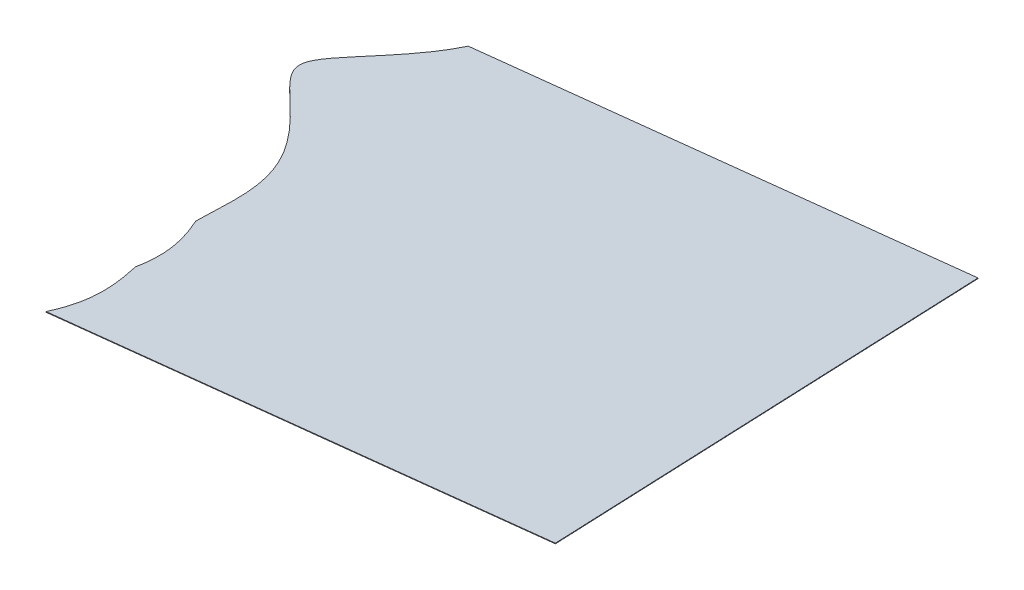
ISO-10303-21;
HEADER;
FILE_DESCRIPTION(('STEP AP214'),'2;1');
FILE_NAME('part.step','',(''),(''),'','','');
FILE_SCHEMA(('AUTOMOTIVE_DESIGN { 1 0 10303 214 1 1 1 1 }'));
ENDSEC;
DATA;
#1=APPLICATION_CONTEXT('core data for automotive mechanical design processes');
#2=APPLICATION_PROTOCOL_DEFINITION('international standard','automotive_design',2000,#1);
#3=PRODUCT_CONTEXT('',#1,'mechanical');
#4=PRODUCT('Part','Part','',(#3));
#5=PRODUCT_RELATED_PRODUCT_CATEGORY('part','',(#4));
#6=PRODUCT_DEFINITION_FORMATION('','',#4);
#7=PRODUCT_DEFINITION_CONTEXT('part definition',#1,'design');
#8=PRODUCT_DEFINITION('design','',#6,#7);
#9=PRODUCT_DEFINITION_SHAPE('','',#8);
#10=(LENGTH_UNIT() NAMED_UNIT(*) SI_UNIT(.MILLI.,.METRE.));
#11=(NAMED_UNIT(*) PLANE_ANGLE_UNIT() SI_UNIT($,.RADIAN.));
#12=(NAMED_UNIT(*) SI_UNIT($,.STERADIAN.) SOLID_ANGLE_UNIT());
#13=UNCERTAINTY_MEASURE_WITH_UNIT(LENGTH_MEASURE(1.E-05),#10,'distance_accuracy_value','');
#14=(GEOMETRIC_REPRESENTATION_CONTEXT(3) GLOBAL_UNCERTAINTY_ASSIGNED_CONTEXT((#13)) GLOBAL_UNIT_ASSIGNED_CONTEXT((#10,
#11,#12)) REPRESENTATION_CONTEXT('',''));
#15=CARTESIAN_POINT('',(0.,0.,0.));
#16=DIRECTION('',(0.,0.,1.));
#17=DIRECTION('',(1.,0.,0.));
#18=AXIS2_PLACEMENT_3D('',#15,#16,#17);
#19=CARTESIAN_POINT('',(1655.15665401852,617.20645742832,330.964538238841));
#20=DIRECTION('',(-0.996335475185747,-0.036820136022395,0.0772003786887326));
#21=DIRECTION('',(0.0772527631007789,0.,0.997011539849612));
#22=AXIS2_PLACEMENT_3D('',#19,#20,#21);
#23=PLANE('',#22);
#24=DIRECTION('',(-0.0758883967493987,-0.0357915138957146,-0.996473742138677));
#25=VECTOR('',#24,1.);
#26=CARTESIAN_POINT('',(1655.16059936024,617.106589353085,330.967824852232));
#27=LINE('',#26,#25);
#28=CARTESIAN_POINT('',(1655.16059936024,617.106589353085,330.967824852232));
#29=VERTEX_POINT('',#28);
#30=CARTESIAN_POINT('',(1649.13643446242,614.265391081862,251.86584884381));
#31=VERTEX_POINT('',#30);
#32=EDGE_CURVE('E176',#29,#31,#27,.T.);
#33=ORIENTED_EDGE('',*,*,#32,.T.);
#34=DIRECTION('',(0.0394534171548831,-0.998680752350993,0.0328661339140675));
#35=VECTOR('',#34,1.);
#36=CARTESIAN_POINT('',(1649.13248912071,614.365259157097,251.862562230418));
#37=LINE('',#36,#35);
#38=CARTESIAN_POINT('',(1649.13248912071,614.365259157097,251.862562230418));
#39=VERTEX_POINT('',#38);
#40=EDGE_CURVE('E13',#39,#31,#37,.T.);
#41=ORIENTED_EDGE('',*,*,#40,.F.);
#42=DIRECTION('',(-0.0758883967493987,-0.0357915138957146,-0.996473742138677));
#43=VECTOR('',#42,1.);
#44=CARTESIAN_POINT('',(1655.15665401852,617.20645742832,330.964538238841));
#45=LINE('',#44,#43);
#46=CARTESIAN_POINT('',(1655.15665401852,617.20645742832,330.964538238841));
#47=VERTEX_POINT('',#46);
#48=EDGE_CURVE('E156',#47,#39,#45,.T.);
#49=ORIENTED_EDGE('',*,*,#48,.F.);
#50=DIRECTION('',(0.0394534171548831,-0.998680752350993,0.0328661339140675));
#51=VECTOR('',#50,1.);
#52=CARTESIAN_POINT('',(1655.15665401852,617.20645742832,330.964538238841));
#53=LINE('',#52,#51);
#54=EDGE_CURVE('E58',#47,#29,#53,.T.);
#55=ORIENTED_EDGE('',*,*,#54,.T.);
#56=EDGE_LOOP('',(#33,#41,#49,#55));
#57=FACE_BOUND('',#56,.T.);
#58=ADVANCED_FACE('F42',(#57),#23,.F.);
#59=CARTESIAN_POINT('',(1649.13248912071,614.365259157097,251.862562230418));
#60=DIRECTION('',(0.0758883967493995,0.0357915138957124,0.996473742138677));
#61=DIRECTION('',(0.997112613623651,0.,-0.0759370512504398));
#62=AXIS2_PLACEMENT_3D('',#59,#60,#61);
#63=PLANE('',#62);
#64=DIRECTION('',(-0.996335475185747,-0.0368201360223934,0.0772003786887332));
#65=VECTOR('',#64,1.);
#66=CARTESIAN_POINT('',(1649.13643446242,614.265391081862,251.86584884381));
#67=LINE('',#66,#65);
#68=CARTESIAN_POINT('',(1567.32972220353,611.242178170211,258.204586470802));
#69=VERTEX_POINT('',#68);
#70=EDGE_CURVE('E174',#31,#69,#67,.T.);
#71=ORIENTED_EDGE('',*,*,#70,.T.);
#72=DIRECTION('',(0.0394534171548831,-0.998680752350993,0.0328661339140675));
#73=VECTOR('',#72,1.);
#74=CARTESIAN_POINT('',(1567.32577686181,611.342046245446,258.20129985741));
#75=LINE('',#74,#73);
#76=CARTESIAN_POINT('',(1567.32577686181,611.342046245446,258.20129985741));
#77=VERTEX_POINT('',#76);
#78=EDGE_CURVE('E50',#77,#69,#75,.T.);
#79=ORIENTED_EDGE('',*,*,#78,.F.);
#80=DIRECTION('',(-0.996335475185747,-0.0368201360223934,0.0772003786887332));
#81=VECTOR('',#80,1.);
#82=CARTESIAN_POINT('',(1649.13248912071,614.365259157097,251.862562230418));
#83=LINE('',#82,#81);
#84=EDGE_CURVE('E91',#39,#77,#83,.T.);
#85=ORIENTED_EDGE('',*,*,#84,.F.);
#86=ORIENTED_EDGE('',*,*,#40,.T.);
#87=EDGE_LOOP('',(#71,#79,#85,#86));
#88=FACE_BOUND('',#87,.T.);
#89=ADVANCED_FACE('F146',(#88),#63,.F.);
#90=CARTESIAN_POINT('',(1567.32577686181,611.342046245446,258.20129985741));
#91=CARTESIAN_POINT('',(1566.94331983609,611.354556161505,259.040542131338));
#92=CARTESIAN_POINT('',(1566.03141489354,611.372960620507,260.694461792502));
#93=CARTESIAN_POINT('',(1565.02286523363,611.385362528978,262.28200104713));
#94=CARTESIAN_POINT('',(1563.93144320108,611.392994379776,263.824078109537));
#95=CARTESIAN_POINT('',(1563.32401569155,611.395028193321,264.615051012943));
#96=CARTESIAN_POINT('',(1562.78444921036,611.396834791805,265.317657430197));
#97=CARTESIAN_POINT('',(1562.15063215641,611.397436627132,266.096796529823));
#98=CARTESIAN_POINT('',(1561.62229934543,611.397938300837,266.746265880772));
#99=CARTESIAN_POINT('',(1560.63575322169,611.397510805001,267.917553139581));
#100=CARTESIAN_POINT('',(1560.03088220946,611.397027708985,268.628977541936));
#101=CARTESIAN_POINT('',(1559.35566634643,611.396513177688,269.423890648507));
#102=CARTESIAN_POINT('',(1559.11000034176,611.396412380457,269.715732066001));
#103=CARTESIAN_POINT('',(1558.76858287483,611.396272296219,270.121322402527));
#104=CARTESIAN_POINT('',(1558.16996258497,611.396539578508,270.84804449746));
#105=CARTESIAN_POINT('',(1557.58050451633,611.397755502209,271.592593726706));
#106=CARTESIAN_POINT('',(1557.01401556851,611.400570438868,272.358158301418));
#107=CARTESIAN_POINT('',(1556.49035944773,611.406003522136,273.151860996516));
#108=CARTESIAN_POINT('',(1556.03924805121,611.415798030268,273.991006632937));
#109=CARTESIAN_POINT('',(1555.72397151437,611.432801624579,274.886149918208));
#110=CARTESIAN_POINT('',(1555.64058387472,611.46008806386,275.815385134095));
#111=CARTESIAN_POINT('',(1555.83927690404,611.497984836317,276.728411848338));
#112=CARTESIAN_POINT('',(1556.25222787751,611.541914529331,277.567555628406));
#113=CARTESIAN_POINT('',(1556.67321592297,611.578705009471,278.180117101658));
#114=CARTESIAN_POINT('',(1556.96216625129,611.602505309528,278.556456581076));
#115=CARTESIAN_POINT('',(1557.34335179667,611.632747156863,279.0178092474));
#116=CARTESIAN_POINT('',(1557.62099248472,611.653820038655,279.324848937074));
#117=CARTESIAN_POINT('',(1557.96857024268,611.680201132358,279.709231239594));
#118=CARTESIAN_POINT('',(1558.41559987236,611.712885110376,280.165750200271));
#119=CARTESIAN_POINT('',(1558.71502610774,611.734777262137,280.471532512445));
#120=CARTESIAN_POINT('',(1559.08439568089,611.761349276841,280.835556702625));
#121=CARTESIAN_POINT('',(1559.37899413108,611.782542344488,281.125891830509));
#122=CARTESIAN_POINT('',(1559.76387331886,611.81000082987,281.49823442858));
#123=CARTESIAN_POINT('',(1560.00843985478,611.827448971688,281.734834749604));
#124=CARTESIAN_POINT('',(1560.93925269822,611.893671868826,282.62973116206));
#125=CARTESIAN_POINT('',(1561.13166982364,611.907380894571,282.815315114329));
#126=CARTESIAN_POINT('',(1561.91448931075,611.963153957798,283.570334887201));
#127=CARTESIAN_POINT('',(1562.47971780974,612.003932859384,284.130939563295));
#128=CARTESIAN_POINT('',(1563.19480351086,612.055523339134,284.840175542317));
#129=CARTESIAN_POINT('',(1563.79918779346,612.10017029205,285.471312364162));
#130=CARTESIAN_POINT('',(1564.48611114247,612.150914554108,286.188641771663));
#131=CARTESIAN_POINT('',(1565.74173006511,612.246970955206,287.600162271624));
#132=CARTESIAN_POINT('',(1566.92963191905,612.342316366183,289.071367844864));
#133=CARTESIAN_POINT('',(1568.03146412699,612.43657425824,290.612848110021));
#134=CARTESIAN_POINT('',(1569.02264299598,612.528935564279,292.2295294437));
#135=CARTESIAN_POINT('',(1569.87906273731,612.618380886209,293.919373348993));
#136=CARTESIAN_POINT('',(1570.58059279982,612.703958681082,295.67763121152));
#137=CARTESIAN_POINT('',(1571.1149653973,612.78463839991,297.487715033681));
#138=CARTESIAN_POINT('',(1571.48609497536,612.860254685335,299.339901205485));
#139=CARTESIAN_POINT('',(1571.7089779204,612.930719624378,301.213516297881));
#140=CARTESIAN_POINT('',(1571.76477674799,612.965791353485,302.212234506579));
#141=CARTESIAN_POINT('',(1571.81337964781,612.996340162661,303.08215602896));
#142=CARTESIAN_POINT('',(1571.82763443207,613.031072820168,304.120441720547));
#143=CARTESIAN_POINT('',(1571.83365899922,613.045752048136,304.559257332606));
#144=CARTESIAN_POINT('',(1571.83427646277,613.062602041831,305.070525356343));
#145=CARTESIAN_POINT('',(1571.83477079783,613.07609197621,305.47984136055));
#146=CARTESIAN_POINT('',(1571.83172339451,613.093906086167,306.024804733953));
#147=CARTESIAN_POINT('',(1571.83153937009,613.094981831941,306.057713593695));
#148=CARTESIAN_POINT('',(1571.82541435353,613.1251773739,306.982597532721));
#149=CARTESIAN_POINT('',(1571.82163957423,613.143786549138,307.552593173767));
#150=CARTESIAN_POINT('',(1571.82086150963,613.156284034321,307.93327972622));
#151=CARTESIAN_POINT('',(1571.81866441963,613.191574291048,309.008258089649));
#152=CARTESIAN_POINT('',(1571.83728629953,613.219423837033,309.83214899241));
#153=B_SPLINE_CURVE_WITH_KNOTS('',2,(#90,#91,#92,#93,#94,#95,#96,#97,#98,#99,#100,#101,#102,
#103,#104,#105,#106,#107,#108,#109,#110,#111,#112,#113,#114,#115,#116,#117,#118,#119,#120,#121,
#122,#123,#124,#125,#126,#127,#128,#129,#130,#131,#132,#133,#134,#135,#136,#137,#138,#139,#140,
#141,#142,#143,#144,#145,#146,#147,#148,#149,#150,#151,#152),.UNSPECIFIED.,.F.,.F.,(3,1,1,1,2,2,
1,1,1,2,1,1,1,1,1,1,1,1,1,1,1,1,2,2,2,2,1,2,2,2,1,1,1,1,1,1,1,1,1,2,2,2,2,2,2,3),(0.,0.03125,
0.0625,0.09375,0.125,0.15625,0.1875,0.203125,0.21875,0.234375,0.25,0.265625,0.28125,0.296875,
0.3125,0.328125,0.34375,0.359375,0.375,0.390625,0.3984375,0.40625,0.418389320373535,0.4375,
0.453125,0.46875,0.484375,0.5,0.53125,0.5625,0.59375,0.625,0.65625,0.6875,0.71875,0.75,0.78125,
0.8125,0.84375,0.875,0.90625,0.921875,0.9375,0.953125,0.96875,1.),.UNSPECIFIED.);
#154=DIRECTION('',(0.0394534171548831,-0.998680752350993,0.0328661339140675));
#155=VECTOR('',#154,1.);
#156=SURFACE_OF_LINEAR_EXTRUSION('',#153,#155);
#157=CARTESIAN_POINT('',(1567.32972220353,611.242178170211,258.204586470802));
#158=CARTESIAN_POINT('',(1566.94726517781,611.25468808627,259.043828744729));
#159=CARTESIAN_POINT('',(1566.03536023526,611.273092545272,260.697748405893));
#160=CARTESIAN_POINT('',(1565.02681057534,611.285494453743,262.285287660521));
#161=CARTESIAN_POINT('',(1563.93538854279,611.293126304541,263.827364722928));
#162=CARTESIAN_POINT('',(1563.32796103327,611.295160118086,264.618337626334));
#163=CARTESIAN_POINT('',(1562.78839455208,611.29696671657,265.320944043589));
#164=CARTESIAN_POINT('',(1562.15457749813,611.297568551896,266.100083143214));
#165=CARTESIAN_POINT('',(1561.62624468715,611.298070225601,266.749552494163));
#166=CARTESIAN_POINT('',(1560.6396985634,611.297642729766,267.920839752972));
#167=CARTESIAN_POINT('',(1560.03482755118,611.29715963375,268.632264155328));
#168=CARTESIAN_POINT('',(1559.35961168814,611.296645102452,269.427177261899));
#169=CARTESIAN_POINT('',(1559.11394568347,611.296544305222,269.719018679393));
#170=CARTESIAN_POINT('',(1558.77252821654,611.296404220984,270.124609015918));
#171=CARTESIAN_POINT('',(1558.17390792668,611.296671503272,270.851331110852));
#172=CARTESIAN_POINT('',(1557.58444985805,611.297887426974,271.595880340098));
#173=CARTESIAN_POINT('',(1557.01796091023,611.300702363633,272.361444914809));
#174=CARTESIAN_POINT('',(1556.49430478944,611.306135446901,273.155147609907));
#175=CARTESIAN_POINT('',(1556.04319339292,611.315929955033,273.994293246328));
#176=CARTESIAN_POINT('',(1555.72791685609,611.332933549343,274.889436531599));
#177=CARTESIAN_POINT('',(1555.64452921643,611.360219988625,275.818671747486));
#178=CARTESIAN_POINT('',(1555.84322224576,611.398116761082,276.73169846173));
#179=CARTESIAN_POINT('',(1556.25617321923,611.442046454096,277.570842241797));
#180=CARTESIAN_POINT('',(1556.67716126469,611.478836934235,278.183403715049));
#181=CARTESIAN_POINT('',(1556.96611159301,611.502637234293,278.559743194468));
#182=CARTESIAN_POINT('',(1557.34729713839,611.532879081628,279.021095860791));
#183=CARTESIAN_POINT('',(1557.62493782643,611.55395196342,279.328135550466));
#184=CARTESIAN_POINT('',(1557.9725155844,611.580333057123,279.712517852986));
#185=CARTESIAN_POINT('',(1558.41954521407,611.61301703514,280.169036813662));
#186=CARTESIAN_POINT('',(1558.71897144945,611.634909186902,280.474819125837));
#187=CARTESIAN_POINT('',(1559.08834102261,611.661481201606,280.838843316016));
#188=CARTESIAN_POINT('',(1559.38293947279,611.682674269253,281.1291784439));
#189=CARTESIAN_POINT('',(1559.76781866058,611.710132754635,281.501521041972));
#190=CARTESIAN_POINT('',(1560.0123851965,611.727580896453,281.738121362995));
#191=CARTESIAN_POINT('',(1560.94319803994,611.793803793591,282.633017775451));
#192=CARTESIAN_POINT('',(1561.13561516536,611.807512819336,282.818601727721));
#193=CARTESIAN_POINT('',(1561.91843465246,611.863285882563,283.573621500592));
#194=CARTESIAN_POINT('',(1562.48366315146,611.904064784149,284.134226176686));
#195=CARTESIAN_POINT('',(1563.19874885257,611.955655263899,284.843462155708));
#196=CARTESIAN_POINT('',(1563.80313313518,612.000302216815,285.474598977553));
#197=CARTESIAN_POINT('',(1564.49005648418,612.051046478873,286.191928385054));
#198=CARTESIAN_POINT('',(1565.74567540683,612.147102879971,287.603448885015));
#199=CARTESIAN_POINT('',(1566.93357726077,612.242448290948,289.074654458256));
#200=CARTESIAN_POINT('',(1568.0354094687,612.336706183005,290.616134723412));
#201=CARTESIAN_POINT('',(1569.0265883377,612.429067489044,292.232816057092));
#202=CARTESIAN_POINT('',(1569.88300807903,612.518512810974,293.922659962384));
#203=CARTESIAN_POINT('',(1570.58453814154,612.604090605847,295.680917824912));
#204=CARTESIAN_POINT('',(1571.11891073902,612.684770324675,297.491001647072));
#205=CARTESIAN_POINT('',(1571.49004031708,612.7603866101,299.343187818877));
#206=CARTESIAN_POINT('',(1571.71292326212,612.830851549143,301.216802911273));
#207=CARTESIAN_POINT('',(1571.76872208971,612.86592327825,302.21552111997));
#208=CARTESIAN_POINT('',(1571.81732498952,612.896472087426,303.085442642352));
#209=CARTESIAN_POINT('',(1571.83157977378,612.931204744933,304.123728333938));
#210=CARTESIAN_POINT('',(1571.83760434094,612.945883972901,304.562543945997));
#211=CARTESIAN_POINT('',(1571.83822180448,612.962733966596,305.073811969735));
#212=CARTESIAN_POINT('',(1571.83871613954,612.976223900975,305.483127973942));
#213=CARTESIAN_POINT('',(1571.83566873622,612.994038010932,306.028091347345));
#214=CARTESIAN_POINT('',(1571.8354847118,612.995113756706,306.061000207086));
#215=CARTESIAN_POINT('',(1571.82935969524,613.025309298665,306.985884146112));
#216=CARTESIAN_POINT('',(1571.82558491595,613.043918473903,307.555879787158));
#217=CARTESIAN_POINT('',(1571.82480685134,613.056415959086,307.936566339611));
#218=CARTESIAN_POINT('',(1571.82260976135,613.091706215813,309.011544703041));
#219=CARTESIAN_POINT('',(1571.84123164125,613.119555761798,309.835435605801));
#220=B_SPLINE_CURVE_WITH_KNOTS('',2,(#157,#158,#159,#160,#161,#162,#163,#164,#165,#166,#167,
#168,#169,#170,#171,#172,#173,#174,#175,#176,#177,#178,#179,#180,#181,#182,#183,#184,#185,#186,
#187,#188,#189,#190,#191,#192,#193,#194,#195,#196,#197,#198,#199,#200,#201,#202,#203,#204,#205,
#206,#207,#208,#209,#210,#211,#212,#213,#214,#215,#216,#217,#218,#219),.UNSPECIFIED.,.F.,.F.,(3,
1,1,1,2,2,1,1,1,2,1,1,1,1,1,1,1,1,1,1,1,1,2,2,2,2,1,2,2,2,1,1,1,1,1,1,1,1,1,2,2,2,2,2,2,3),(0.,
0.03125,0.0625,0.09375,0.125,0.15625,0.1875,0.203125,0.21875,0.234375,0.25,0.265625,0.28125,
0.296875,0.3125,0.328125,0.34375,0.359375,0.375,0.390625,0.3984375,0.40625,0.418389320373535,
0.4375,0.453125,0.46875,0.484375,0.5,0.53125,0.5625,0.59375,0.625,0.65625,0.6875,0.71875,0.75,
0.78125,0.8125,0.84375,0.875,0.90625,0.921875,0.9375,0.953125,0.96875,1.),.UNSPECIFIED.);
#221=CARTESIAN_POINT('',(1571.84123161385,613.119555720822,309.835434393596));
#222=VERTEX_POINT('',#221);
#223=EDGE_CURVE('E172',#69,#222,#220,.T.);
#224=ORIENTED_EDGE('',*,*,#223,.T.);
#225=DIRECTION('',(0.0394534171548831,-0.998680752350993,0.0328661339140675));
#226=VECTOR('',#225,1.);
#227=CARTESIAN_POINT('',(1571.83728627213,613.219423796057,309.832147780204));
#228=LINE('',#227,#226);
#229=CARTESIAN_POINT('',(1571.83728627213,613.219423796057,309.832147780204));
#230=VERTEX_POINT('',#229);
#231=EDGE_CURVE('E119',#230,#222,#228,.T.);
#232=ORIENTED_EDGE('',*,*,#231,.F.);
#233=EDGE_CURVE('E107',#77,#230,#153,.T.);
#234=ORIENTED_EDGE('',*,*,#233,.F.);
#235=ORIENTED_EDGE('',*,*,#78,.T.);
#236=EDGE_LOOP('',(#224,#232,#234,#235));
#237=FACE_BOUND('',#236,.T.);
#238=ADVANCED_FACE('F144',(#237),#156,.F.);
#239=CARTESIAN_POINT('',(1571.83728629953,613.219423837033,309.83214899241));
#240=CARTESIAN_POINT('',(1572.20716136136,613.259393529501,310.602672458978));
#241=CARTESIAN_POINT('',(1572.8383015818,613.332887036993,312.078231253993));
#242=CARTESIAN_POINT('',(1573.38363969341,613.404438307202,313.597771839047));
#243=CARTESIAN_POINT('',(1573.81586568981,613.472738412779,315.154304421068));
#244=CARTESIAN_POINT('',(1574.11401893622,613.536841332657,316.74424463069));
#245=CARTESIAN_POINT('',(1574.26371068422,613.595650878482,318.351555993486));
#246=CARTESIAN_POINT('',(1574.26309847111,613.648860807408,319.969144660604));
#247=CARTESIAN_POINT('',(1574.11867474654,613.696247121456,321.582410442197));
#248=CARTESIAN_POINT('',(1573.97982609803,613.717787988366,322.403635807308));
#249=B_SPLINE_CURVE_WITH_KNOTS('',2,(#239,#240,#241,#242,#243,#244,#245,#246,#247,#248),
.UNSPECIFIED.,.F.,.F.,(3,1,1,1,1,1,1,1,3),(0.,0.125,0.25,0.375,0.5,0.625,0.75,0.875,1.),.UNSPECIFIED.);
#250=DIRECTION('',(0.0394534171548831,-0.998680752350993,0.0328661339140675));
#251=VECTOR('',#250,1.);
#252=SURFACE_OF_LINEAR_EXTRUSION('',#249,#251);
#253=CARTESIAN_POINT('',(1571.84123164125,613.119555761798,309.835435605801));
#254=CARTESIAN_POINT('',(1572.21110670307,613.159525454266,310.605959072369));
#255=CARTESIAN_POINT('',(1572.84224692352,613.233018961758,312.081517867385));
#256=CARTESIAN_POINT('',(1573.38758503512,613.304570231967,313.601058452438));
#257=CARTESIAN_POINT('',(1573.81981103152,613.372870337544,315.157591034459));
#258=CARTESIAN_POINT('',(1574.11796427793,613.436973257422,316.747531244081));
#259=CARTESIAN_POINT('',(1574.26765602594,613.495782803247,318.354842606877));
#260=CARTESIAN_POINT('',(1574.26704381282,613.548992732173,319.972431273996));
#261=CARTESIAN_POINT('',(1574.12262008826,613.596379046221,321.585697055588));
#262=CARTESIAN_POINT('',(1573.98377143975,613.617919913131,322.406922420699));
#263=B_SPLINE_CURVE_WITH_KNOTS('',2,(#253,#254,#255,#256,#257,#258,#259,#260,#261,#262),
.UNSPECIFIED.,.F.,.F.,(3,1,1,1,1,1,1,1,3),(0.,0.125,0.25,0.375,0.5,0.625,0.75,0.875,1.),.UNSPECIFIED.);
#264=CARTESIAN_POINT('',(1573.98377164829,613.617919880779,322.406921187294));
#265=VERTEX_POINT('',#264);
#266=EDGE_CURVE('E116',#222,#265,#263,.T.);
#267=ORIENTED_EDGE('',*,*,#266,.T.);
#268=DIRECTION('',(0.0394534171548831,-0.998680752350993,0.0328661339140675));
#269=VECTOR('',#268,1.);
#270=CARTESIAN_POINT('',(1573.97982630657,613.717787956014,322.403634573903));
#271=LINE('',#270,#269);
#272=CARTESIAN_POINT('',(1573.97982630657,613.717787956014,322.403634573903));
#273=VERTEX_POINT('',#272);
#274=EDGE_CURVE('E113',#273,#265,#271,.T.);
#275=ORIENTED_EDGE('',*,*,#274,.F.);
#276=EDGE_CURVE('E100',#230,#273,#249,.T.);
#277=ORIENTED_EDGE('',*,*,#276,.F.);
#278=ORIENTED_EDGE('',*,*,#231,.T.);
#279=EDGE_LOOP('',(#267,#275,#277,#278));
#280=FACE_BOUND('',#279,.T.);
#281=ADVANCED_FACE('F114',(#280),#252,.F.);
#282=CARTESIAN_POINT('',(1573.97982609803,613.717787988366,322.403635807308));
#283=CARTESIAN_POINT('',(1574.23105762763,613.760428673285,323.397743877362));
#284=CARTESIAN_POINT('',(1574.41327668485,613.794610902143,324.217675105837));
#285=CARTESIAN_POINT('',(1574.43308427239,613.798354263453,324.30764449144));
#286=CARTESIAN_POINT('',(1574.63733540209,613.837305059404,325.246026999736));
#287=CARTESIAN_POINT('',(1574.77547874918,613.870065001395,326.075649871899));
#288=CARTESIAN_POINT('',(1574.79027477202,613.873628499426,326.166169895978));
#289=CARTESIAN_POINT('',(1574.94739928878,613.912218656568,327.150166010266));
#290=CARTESIAN_POINT('',(1575.10174873528,613.978565784318,328.980925494001));
#291=CARTESIAN_POINT('',(1575.08036423627,614.039872827301,330.869491260006));
#292=CARTESIAN_POINT('',(1574.85574406836,614.092910414965,332.7507484623));
#293=CARTESIAN_POINT('',(1574.42711520302,614.136844631374,334.600285432015));
#294=CARTESIAN_POINT('',(1573.80704770332,614.171719984621,336.404365154441));
#295=CARTESIAN_POINT('',(1573.40477121572,614.185270769956,337.299027442607));
#296=B_SPLINE_CURVE_WITH_KNOTS('',2,(#282,#283,#284,#285,#286,#287,#288,#289,#290,#291,#292,
#293,#294,#295),.UNSPECIFIED.,.F.,.F.,(3,1,1,1,1,1,1,1,1,1,1,1,3),(0.,0.11875,0.125,0.13125,
0.2440625,0.25,0.25625,0.375,0.5,0.625,0.75,0.875,1.),.UNSPECIFIED.);
#297=DIRECTION('',(0.0394534171548831,-0.998680752350993,0.0328661339140675));
#298=VECTOR('',#297,1.);
#299=SURFACE_OF_LINEAR_EXTRUSION('',#296,#298);
#300=CARTESIAN_POINT('',(1573.98377143975,613.617919913131,322.406922420699));
#301=CARTESIAN_POINT('',(1574.23500296934,613.66056059805,323.401030490753));
#302=CARTESIAN_POINT('',(1574.41722202657,613.694742826908,324.220961719228));
#303=CARTESIAN_POINT('',(1574.43702961411,613.698486188218,324.310931104832));
#304=CARTESIAN_POINT('',(1574.6412807438,613.737436984169,325.249313613127));
#305=CARTESIAN_POINT('',(1574.7794240909,613.77019692616,326.078936485291));
#306=CARTESIAN_POINT('',(1574.79422011374,613.773760424191,326.169456509369));
#307=CARTESIAN_POINT('',(1574.9513446305,613.812350581333,327.153452623657));
#308=CARTESIAN_POINT('',(1575.105694077,613.878697709083,328.984212107392));
#309=CARTESIAN_POINT('',(1575.08430957799,613.940004752066,330.872777873397));
#310=CARTESIAN_POINT('',(1574.85968941007,613.99304233973,332.754035075692));
#311=CARTESIAN_POINT('',(1574.43106054474,614.036976556139,334.603572045406));
#312=CARTESIAN_POINT('',(1573.81099304504,614.071851909386,336.407651767832));
#313=CARTESIAN_POINT('',(1573.40871655744,614.085402694721,337.302314055999));
#314=B_SPLINE_CURVE_WITH_KNOTS('',2,(#300,#301,#302,#303,#304,#305,#306,#307,#308,#309,#310,
#311,#312,#313),.UNSPECIFIED.,.F.,.F.,(3,1,1,1,1,1,1,1,1,1,1,1,3),(0.,0.11875,0.125,0.13125,
0.2440625,0.25,0.25625,0.375,0.5,0.625,0.75,0.875,1.),.UNSPECIFIED.);
#315=CARTESIAN_POINT('',(1573.40871655744,614.085402694721,337.302314055999));
#316=VERTEX_POINT('',#315);
#317=EDGE_CURVE('E160',#265,#316,#314,.T.);
#318=ORIENTED_EDGE('',*,*,#317,.T.);
#319=DIRECTION('',(0.0394534171548831,-0.998680752350993,0.0328661339140675));
#320=VECTOR('',#319,1.);
#321=CARTESIAN_POINT('',(1573.40477121572,614.185270769956,337.299027442607));
#322=LINE('',#321,#320);
#323=CARTESIAN_POINT('',(1573.40477121572,614.185270769956,337.299027442607));
#324=VERTEX_POINT('',#323);
#325=EDGE_CURVE('E79',#324,#316,#322,.T.);
#326=ORIENTED_EDGE('',*,*,#325,.F.);
#327=EDGE_CURVE('E105',#273,#324,#296,.T.);
#328=ORIENTED_EDGE('',*,*,#327,.F.);
#329=ORIENTED_EDGE('',*,*,#274,.T.);
#330=EDGE_LOOP('',(#318,#326,#328,#329));
#331=FACE_BOUND('',#330,.T.);
#332=ADVANCED_FACE('F121',(#331),#299,.F.);
#333=CARTESIAN_POINT('',(1655.15665401852,617.20645742832,330.964538238841));
#334=DIRECTION('',(0.0758883967493986,0.0357915138957124,0.996473742138677));
#335=DIRECTION('',(0.997112613623651,0.,-0.0759370512504389));
#336=AXIS2_PLACEMENT_3D('',#333,#334,#335);
#337=PLANE('',#336);
#338=DIRECTION('',(-0.996335475185747,-0.0368201360223939,0.0772003786887323));
#339=VECTOR('',#338,1.);
#340=CARTESIAN_POINT('',(1655.16059936024,617.106589353085,330.967824852232));
#341=LINE('',#340,#339);
#342=EDGE_CURVE('E157',#29,#316,#341,.T.);
#343=ORIENTED_EDGE('',*,*,#342,.F.);
#344=ORIENTED_EDGE('',*,*,#54,.F.);
#345=DIRECTION('',(-0.996335475185747,-0.0368201360223939,0.0772003786887323));
#346=VECTOR('',#345,1.);
#347=CARTESIAN_POINT('',(1655.15665401852,617.20645742832,330.964538238841));
#348=LINE('',#347,#346);
#349=EDGE_CURVE('E122',#47,#324,#348,.T.);
#350=ORIENTED_EDGE('',*,*,#349,.T.);
#351=ORIENTED_EDGE('',*,*,#325,.T.);
#352=EDGE_LOOP('',(#343,#344,#350,#351));
#353=FACE_BOUND('',#352,.T.);
#354=ADVANCED_FACE('F140',(#353),#337,.T.);
#355=CARTESIAN_POINT('',(2529.66623413217,615.349277157291,-775.253843136527));
#356=DIRECTION('',(-0.0394534171548821,0.998680752350993,-0.0328661339140692));
#357=DIRECTION('',(-0.999220568580464,-0.039474742883688,0.));
#358=AXIS2_PLACEMENT_3D('',#355,#356,#357);
#359=PLANE('',#358);
#360=ORIENTED_EDGE('',*,*,#48,.T.);
#361=ORIENTED_EDGE('',*,*,#84,.T.);
#362=ORIENTED_EDGE('',*,*,#233,.T.);
#363=ORIENTED_EDGE('',*,*,#276,.T.);
#364=ORIENTED_EDGE('',*,*,#327,.T.);
#365=ORIENTED_EDGE('',*,*,#349,.F.);
#366=EDGE_LOOP('',(#360,#361,#362,#363,#364,#365));
#367=FACE_BOUND('',#366,.T.);
#368=ADVANCED_FACE('F102',(#367),#359,.T.);
#369=CARTESIAN_POINT('',(2529.67017947388,615.249409082056,-775.250556523136));
#370=DIRECTION('',(-0.0394534171548821,0.998680752350993,-0.0328661339140692));
#371=DIRECTION('',(-0.999220568580464,-0.039474742883688,0.));
#372=AXIS2_PLACEMENT_3D('',#369,#370,#371);
#373=PLANE('',#372);
#374=ORIENTED_EDGE('',*,*,#32,.F.);
#375=ORIENTED_EDGE('',*,*,#342,.T.);
#376=ORIENTED_EDGE('',*,*,#317,.F.);
#377=ORIENTED_EDGE('',*,*,#266,.F.);
#378=ORIENTED_EDGE('',*,*,#223,.F.);
#379=ORIENTED_EDGE('',*,*,#70,.F.);
#380=EDGE_LOOP('',(#374,#375,#376,#377,#378,#379));
#381=FACE_BOUND('',#380,.T.);
#382=ADVANCED_FACE('F173',(#381),#373,.F.);
#383=CLOSED_SHELL('',(#58,#89,#238,#281,#332,#354,#368,#382));
#384=MANIFOLD_SOLID_BREP('B2',#383);
#385=ADVANCED_BREP_SHAPE_REPRESENTATION('',(#18,#384),#14);
#386=SHAPE_DEFINITION_REPRESENTATION(#9,#385);
ENDSEC;
END-ISO-10303-21;
